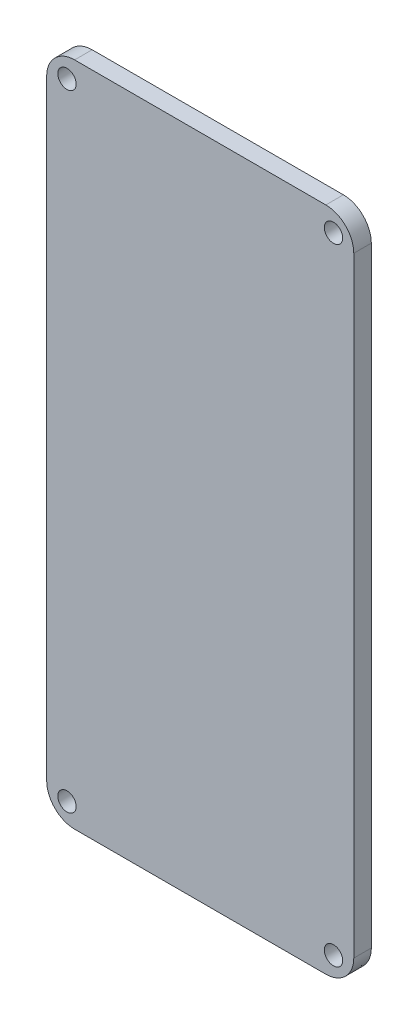
ISO-10303-21;
HEADER;
FILE_DESCRIPTION(('STEP AP214'),'2;1');
FILE_NAME('part.step','',(''),(''),'','','');
FILE_SCHEMA(('AUTOMOTIVE_DESIGN { 1 0 10303 214 1 1 1 1 }'));
ENDSEC;
DATA;
#1=APPLICATION_CONTEXT('core data for automotive mechanical design processes');
#2=APPLICATION_PROTOCOL_DEFINITION('international standard','automotive_design',2000,#1);
#3=PRODUCT_CONTEXT('',#1,'mechanical');
#4=PRODUCT('Part','Part','',(#3));
#5=PRODUCT_RELATED_PRODUCT_CATEGORY('part','',(#4));
#6=PRODUCT_DEFINITION_FORMATION('','',#4);
#7=PRODUCT_DEFINITION_CONTEXT('part definition',#1,'design');
#8=PRODUCT_DEFINITION('design','',#6,#7);
#9=PRODUCT_DEFINITION_SHAPE('','',#8);
#10=(LENGTH_UNIT() NAMED_UNIT(*) SI_UNIT(.MILLI.,.METRE.));
#11=(NAMED_UNIT(*) PLANE_ANGLE_UNIT() SI_UNIT($,.RADIAN.));
#12=(NAMED_UNIT(*) SI_UNIT($,.STERADIAN.) SOLID_ANGLE_UNIT());
#13=UNCERTAINTY_MEASURE_WITH_UNIT(LENGTH_MEASURE(1.E-05),#10,'distance_accuracy_value','');
#14=(GEOMETRIC_REPRESENTATION_CONTEXT(3) GLOBAL_UNCERTAINTY_ASSIGNED_CONTEXT((#13)) GLOBAL_UNIT_ASSIGNED_CONTEXT((#10,
#11,#12)) REPRESENTATION_CONTEXT('',''));
#15=CARTESIAN_POINT('',(0.,0.,0.));
#16=DIRECTION('',(0.,0.,1.));
#17=DIRECTION('',(1.,0.,0.));
#18=AXIS2_PLACEMENT_3D('',#15,#16,#17);
#19=CARTESIAN_POINT('',(15.9393993481628,54.3958704339727,3.));
#20=DIRECTION('',(0.,0.,1.));
#21=DIRECTION('',(1.,0.,0.));
#22=AXIS2_PLACEMENT_3D('',#19,#20,#21);
#23=PLANE('',#22);
#24=CARTESIAN_POINT('',(-31.7271852056061,-54.7317695398175,3.));
#25=DIRECTION('',(0.,0.,1.));
#26=DIRECTION('',(-1.,0.,0.));
#27=AXIS2_PLACEMENT_3D('',#24,#25,#26);
#28=ELLIPSE('',#27,1.57121739092703,1.57121739092703);
#29=CARTESIAN_POINT('',(-33.2984025965332,-54.7317695398175,3.));
#30=VERTEX_POINT('',#29);
#31=EDGE_CURVE('E365',#30,#30,#28,.T.);
#32=ORIENTED_EDGE('',*,*,#31,.F.);
#33=EDGE_LOOP('',(#32));
#34=FACE_BOUND('',#33,.T.);
#35=CARTESIAN_POINT('',(-31.7271852056061,52.3290999996864,3.));
#36=DIRECTION('',(0.,0.,1.));
#37=DIRECTION('',(-1.,0.,0.));
#38=AXIS2_PLACEMENT_3D('',#35,#36,#37);
#39=ELLIPSE('',#38,1.57121739092703,1.57121739092703);
#40=CARTESIAN_POINT('',(-33.2984025965332,52.3290999996864,3.));
#41=VERTEX_POINT('',#40);
#42=EDGE_CURVE('E196',#41,#41,#39,.T.);
#43=ORIENTED_EDGE('',*,*,#42,.F.);
#44=EDGE_LOOP('',(#43));
#45=FACE_BOUND('',#44,.T.);
#46=CARTESIAN_POINT('',(17.3423799999998,51.0226600000001,3.));
#47=CARTESIAN_POINT('',(17.3423799999998,53.6496165211084,3.));
#48=CARTESIAN_POINT('',(15.1931330439942,55.798863477114,3.));
#49=CARTESIAN_POINT('',(12.5662756533208,55.798863477114,3.));
#50=B_SPLINE_CURVE_WITH_KNOTS('',3,(#46,#47,#48,#49),.UNSPECIFIED.,.F.,.F.,(4,4),
(0.111111111111111,0.222222222222222),.UNSPECIFIED.);
#51=CARTESIAN_POINT('',(17.3423799999998,51.0226600000001,3.));
#52=VERTEX_POINT('',#51);
#53=CARTESIAN_POINT('',(12.5662756533208,55.798863477114,3.));
#54=VERTEX_POINT('',#53);
#55=EDGE_CURVE('E206',#52,#54,#50,.T.);
#56=ORIENTED_EDGE('',*,*,#55,.T.);
#57=DIRECTION('',(-1.,0.,0.));
#58=VECTOR('',#57,1.);
#59=CARTESIAN_POINT('',(-30.4205469450504,55.798863477114,3.));
#60=LINE('',#59,#58);
#61=CARTESIAN_POINT('',(-30.4205469450504,55.798863477114,3.));
#62=VERTEX_POINT('',#61);
#63=EDGE_CURVE('E94',#54,#62,#60,.T.);
#64=ORIENTED_EDGE('',*,*,#63,.T.);
#65=CARTESIAN_POINT('',(-30.4205469450504,55.798863477114,3.));
#66=CARTESIAN_POINT('',(-33.0474043357237,55.798863477114,3.));
#67=CARTESIAN_POINT('',(-35.1967504221641,53.6496165211084,3.));
#68=CARTESIAN_POINT('',(-35.1967504221641,51.0226600000001,3.));
#69=B_SPLINE_CURVE_WITH_KNOTS('',3,(#65,#66,#67,#68),.UNSPECIFIED.,.F.,.F.,(4,4),
(0.777777777777778,1.),.UNSPECIFIED.);
#70=CARTESIAN_POINT('',(-35.1967504221641,51.0226600000001,3.));
#71=VERTEX_POINT('',#70);
#72=EDGE_CURVE('E160',#62,#71,#69,.T.);
#73=ORIENTED_EDGE('',*,*,#72,.T.);
#74=DIRECTION('',(0.,-1.,0.));
#75=VECTOR('',#74,1.);
#76=CARTESIAN_POINT('',(-35.1967504221641,-53.425032148827,3.));
#77=LINE('',#76,#75);
#78=CARTESIAN_POINT('',(-35.1967504221641,-53.425032148827,3.));
#79=VERTEX_POINT('',#78);
#80=EDGE_CURVE('E155',#71,#79,#77,.T.);
#81=ORIENTED_EDGE('',*,*,#80,.T.);
#82=CARTESIAN_POINT('',(-35.1967504221641,-53.425032148827,3.));
#83=CARTESIAN_POINT('',(-35.1967504221641,-56.0519886699353,3.));
#84=CARTESIAN_POINT('',(-33.0474043357237,-58.2012356259407,3.));
#85=CARTESIAN_POINT('',(-30.4205469450504,-58.2012356259407,3.));
#86=B_SPLINE_CURVE_WITH_KNOTS('',3,(#82,#83,#84,#85),.UNSPECIFIED.,.F.,.F.,(4,4),
(0.555555555555556,0.666666666666667),.UNSPECIFIED.);
#87=CARTESIAN_POINT('',(-30.4205469450504,-58.2012356259407,3.));
#88=VERTEX_POINT('',#87);
#89=EDGE_CURVE('E113',#79,#88,#86,.T.);
#90=ORIENTED_EDGE('',*,*,#89,.T.);
#91=DIRECTION('',(1.,0.,0.));
#92=VECTOR('',#91,1.);
#93=CARTESIAN_POINT('',(12.5662756533208,-58.2012356259407,3.));
#94=LINE('',#93,#92);
#95=CARTESIAN_POINT('',(12.5662756533208,-58.2012356259407,3.));
#96=VERTEX_POINT('',#95);
#97=EDGE_CURVE('E107',#88,#96,#94,.T.);
#98=ORIENTED_EDGE('',*,*,#97,.T.);
#99=CARTESIAN_POINT('',(12.5662756533208,-58.2012356259407,3.));
#100=CARTESIAN_POINT('',(15.1931330439942,-58.2012356259407,3.));
#101=CARTESIAN_POINT('',(17.3423799999998,-56.0519886699353,3.));
#102=CARTESIAN_POINT('',(17.3423799999998,-53.425032148827,3.));
#103=B_SPLINE_CURVE_WITH_KNOTS('',3,(#99,#100,#101,#102),.UNSPECIFIED.,.F.,.F.,(4,4),
(0.333333333333333,0.444444444444444),.UNSPECIFIED.);
#104=CARTESIAN_POINT('',(17.3423799999998,-53.425032148827,3.));
#105=VERTEX_POINT('',#104);
#106=EDGE_CURVE('E111',#96,#105,#103,.T.);
#107=ORIENTED_EDGE('',*,*,#106,.T.);
#108=DIRECTION('',(0.,1.,0.));
#109=VECTOR('',#108,1.);
#110=CARTESIAN_POINT('',(17.3423799999998,51.0226600000001,3.));
#111=LINE('',#110,#109);
#112=EDGE_CURVE('E51',#105,#52,#111,.T.);
#113=ORIENTED_EDGE('',*,*,#112,.T.);
#114=EDGE_LOOP('',(#56,#64,#73,#81,#90,#98,#107,#113));
#115=FACE_BOUND('',#114,.T.);
#116=CARTESIAN_POINT('',(13.8728147834418,52.3290999996864,3.));
#117=DIRECTION('',(0.,0.,1.));
#118=DIRECTION('',(0.,1.,0.));
#119=AXIS2_PLACEMENT_3D('',#116,#117,#118);
#120=ELLIPSE('',#119,1.57121739092703,1.5712173909268);
#121=CARTESIAN_POINT('',(13.8728147834418,53.9003173906134,3.));
#122=VERTEX_POINT('',#121);
#123=EDGE_CURVE('E205',#122,#122,#120,.T.);
#124=ORIENTED_EDGE('',*,*,#123,.F.);
#125=EDGE_LOOP('',(#124));
#126=FACE_BOUND('',#125,.T.);
#127=CARTESIAN_POINT('',(13.8728147834418,-54.7317695398175,3.));
#128=DIRECTION('',(0.,0.,1.));
#129=DIRECTION('',(0.,1.,0.));
#130=AXIS2_PLACEMENT_3D('',#127,#128,#129);
#131=ELLIPSE('',#130,1.57121739092703,1.5712173909268);
#132=CARTESIAN_POINT('',(13.8728147834418,-53.1605521488905,3.));
#133=VERTEX_POINT('',#132);
#134=EDGE_CURVE('E359',#133,#133,#131,.T.);
#135=ORIENTED_EDGE('',*,*,#134,.F.);
#136=EDGE_LOOP('',(#135));
#137=FACE_BOUND('',#136,.T.);
#138=ADVANCED_FACE('F33',(#34,#45,#115,#126,#137),#23,.T.);
#139=CARTESIAN_POINT('',(15.9393993481628,54.3958704339727,0.));
#140=DIRECTION('',(0.,0.,1.));
#141=DIRECTION('',(1.,0.,0.));
#142=AXIS2_PLACEMENT_3D('',#139,#140,#141);
#143=PLANE('',#142);
#144=CARTESIAN_POINT('',(17.3423799999998,51.0226600000001,0.));
#145=CARTESIAN_POINT('',(17.3423799999998,53.6496165211084,0.));
#146=CARTESIAN_POINT('',(15.1931330439942,55.798863477114,0.));
#147=CARTESIAN_POINT('',(12.5662756533208,55.798863477114,0.));
#148=B_SPLINE_CURVE_WITH_KNOTS('',3,(#144,#145,#146,#147),.UNSPECIFIED.,.F.,.F.,(4,4),
(0.111111111111111,0.222222222222222),.UNSPECIFIED.);
#149=CARTESIAN_POINT('',(17.3423799999998,51.0226600000001,0.));
#150=VERTEX_POINT('',#149);
#151=CARTESIAN_POINT('',(12.5662756533208,55.798863477114,0.));
#152=VERTEX_POINT('',#151);
#153=EDGE_CURVE('E201',#150,#152,#148,.T.);
#154=ORIENTED_EDGE('',*,*,#153,.F.);
#155=DIRECTION('',(0.,1.,0.));
#156=VECTOR('',#155,1.);
#157=CARTESIAN_POINT('',(17.3423799999998,51.0226600000001,0.));
#158=LINE('',#157,#156);
#159=CARTESIAN_POINT('',(17.3423799999998,-53.425032148827,0.));
#160=VERTEX_POINT('',#159);
#161=EDGE_CURVE('E86',#160,#150,#158,.T.);
#162=ORIENTED_EDGE('',*,*,#161,.F.);
#163=CARTESIAN_POINT('',(12.5662756533208,-58.2012356259407,0.));
#164=CARTESIAN_POINT('',(15.1931330439942,-58.2012356259407,0.));
#165=CARTESIAN_POINT('',(17.3423799999998,-56.0519886699353,0.));
#166=CARTESIAN_POINT('',(17.3423799999998,-53.425032148827,0.));
#167=B_SPLINE_CURVE_WITH_KNOTS('',3,(#163,#164,#165,#166),.UNSPECIFIED.,.F.,.F.,(4,4),
(0.333333333333333,0.444444444444444),.UNSPECIFIED.);
#168=CARTESIAN_POINT('',(12.5662756533208,-58.2012356259407,0.));
#169=VERTEX_POINT('',#168);
#170=EDGE_CURVE('E80',#169,#160,#167,.T.);
#171=ORIENTED_EDGE('',*,*,#170,.F.);
#172=DIRECTION('',(1.,0.,0.));
#173=VECTOR('',#172,1.);
#174=CARTESIAN_POINT('',(12.5662756533208,-58.2012356259407,0.));
#175=LINE('',#174,#173);
#176=CARTESIAN_POINT('',(-30.4205469450504,-58.2012356259407,0.));
#177=VERTEX_POINT('',#176);
#178=EDGE_CURVE('E121',#177,#169,#175,.T.);
#179=ORIENTED_EDGE('',*,*,#178,.F.);
#180=CARTESIAN_POINT('',(-35.1967504221641,-53.425032148827,0.));
#181=CARTESIAN_POINT('',(-35.1967504221641,-56.0519886699353,0.));
#182=CARTESIAN_POINT('',(-33.0474043357237,-58.2012356259407,0.));
#183=CARTESIAN_POINT('',(-30.4205469450504,-58.2012356259407,0.));
#184=B_SPLINE_CURVE_WITH_KNOTS('',3,(#180,#181,#182,#183),.UNSPECIFIED.,.F.,.F.,(4,4),
(0.555555555555556,0.666666666666667),.UNSPECIFIED.);
#185=CARTESIAN_POINT('',(-35.1967504221641,-53.425032148827,0.));
#186=VERTEX_POINT('',#185);
#187=EDGE_CURVE('E241',#186,#177,#184,.T.);
#188=ORIENTED_EDGE('',*,*,#187,.F.);
#189=DIRECTION('',(0.,-1.,0.));
#190=VECTOR('',#189,1.);
#191=CARTESIAN_POINT('',(-35.1967504221641,-53.425032148827,0.));
#192=LINE('',#191,#190);
#193=CARTESIAN_POINT('',(-35.1967504221641,51.0226600000001,0.));
#194=VERTEX_POINT('',#193);
#195=EDGE_CURVE('E239',#194,#186,#192,.T.);
#196=ORIENTED_EDGE('',*,*,#195,.F.);
#197=CARTESIAN_POINT('',(-30.4205469450504,55.798863477114,0.));
#198=CARTESIAN_POINT('',(-33.0474043357237,55.798863477114,0.));
#199=CARTESIAN_POINT('',(-35.1967504221641,53.6496165211084,0.));
#200=CARTESIAN_POINT('',(-35.1967504221641,51.0226600000001,0.));
#201=B_SPLINE_CURVE_WITH_KNOTS('',3,(#197,#198,#199,#200),.UNSPECIFIED.,.F.,.F.,(4,4),
(0.777777777777778,1.),.UNSPECIFIED.);
#202=CARTESIAN_POINT('',(-30.4205469450504,55.798863477114,0.));
#203=VERTEX_POINT('',#202);
#204=EDGE_CURVE('E233',#203,#194,#201,.T.);
#205=ORIENTED_EDGE('',*,*,#204,.F.);
#206=DIRECTION('',(-1.,0.,0.));
#207=VECTOR('',#206,1.);
#208=CARTESIAN_POINT('',(-30.4205469450504,55.798863477114,0.));
#209=LINE('',#208,#207);
#210=EDGE_CURVE('E237',#152,#203,#209,.T.);
#211=ORIENTED_EDGE('',*,*,#210,.F.);
#212=EDGE_LOOP('',(#154,#162,#171,#179,#188,#196,#205,#211));
#213=FACE_BOUND('',#212,.T.);
#214=CARTESIAN_POINT('',(-31.7271852056061,52.3290999996864,0.));
#215=DIRECTION('',(0.,0.,1.));
#216=DIRECTION('',(-1.,0.,0.));
#217=AXIS2_PLACEMENT_3D('',#214,#215,#216);
#218=ELLIPSE('',#217,1.57121739092703,1.57121739092703);
#219=CARTESIAN_POINT('',(-33.2984025965332,52.3290999996864,0.));
#220=VERTEX_POINT('',#219);
#221=EDGE_CURVE('E202',#220,#220,#218,.T.);
#222=ORIENTED_EDGE('',*,*,#221,.T.);
#223=EDGE_LOOP('',(#222));
#224=FACE_BOUND('',#223,.T.);
#225=CARTESIAN_POINT('',(13.8728147834418,52.3290999996864,0.));
#226=DIRECTION('',(0.,0.,1.));
#227=DIRECTION('',(0.,1.,0.));
#228=AXIS2_PLACEMENT_3D('',#225,#226,#227);
#229=ELLIPSE('',#228,1.57121739092703,1.5712173909268);
#230=CARTESIAN_POINT('',(13.8728147834418,53.9003173906134,0.));
#231=VERTEX_POINT('',#230);
#232=EDGE_CURVE('E203',#231,#231,#229,.T.);
#233=ORIENTED_EDGE('',*,*,#232,.T.);
#234=EDGE_LOOP('',(#233));
#235=FACE_BOUND('',#234,.T.);
#236=CARTESIAN_POINT('',(-31.7271852056061,-54.7317695398175,0.));
#237=DIRECTION('',(0.,0.,1.));
#238=DIRECTION('',(-1.,0.,0.));
#239=AXIS2_PLACEMENT_3D('',#236,#237,#238);
#240=ELLIPSE('',#239,1.57121739092703,1.57121739092703);
#241=CARTESIAN_POINT('',(-33.2984025965332,-54.7317695398175,0.));
#242=VERTEX_POINT('',#241);
#243=EDGE_CURVE('E362',#242,#242,#240,.T.);
#244=ORIENTED_EDGE('',*,*,#243,.T.);
#245=EDGE_LOOP('',(#244));
#246=FACE_BOUND('',#245,.T.);
#247=CARTESIAN_POINT('',(13.8728147834418,-54.7317695398175,0.));
#248=DIRECTION('',(0.,0.,1.));
#249=DIRECTION('',(0.,1.,0.));
#250=AXIS2_PLACEMENT_3D('',#247,#248,#249);
#251=ELLIPSE('',#250,1.57121739092703,1.5712173909268);
#252=CARTESIAN_POINT('',(13.8728147834418,-53.1605521488905,0.));
#253=VERTEX_POINT('',#252);
#254=EDGE_CURVE('E363',#253,#253,#251,.T.);
#255=ORIENTED_EDGE('',*,*,#254,.T.);
#256=EDGE_LOOP('',(#255));
#257=FACE_BOUND('',#256,.T.);
#258=ADVANCED_FACE('F176',(#213,#224,#235,#246,#257),#143,.F.);
#259=DIRECTION('',(0.,0.,-1.));
#260=VECTOR('',#259,1.);
#261=SURFACE_OF_LINEAR_EXTRUSION('',#50,#260);
#262=ORIENTED_EDGE('',*,*,#153,.T.);
#263=DIRECTION('',(0.,0.,-1.));
#264=VECTOR('',#263,1.);
#265=CARTESIAN_POINT('',(12.5662756533208,55.798863477114,3.));
#266=LINE('',#265,#264);
#267=EDGE_CURVE('E11',#54,#152,#266,.T.);
#268=ORIENTED_EDGE('',*,*,#267,.F.);
#269=ORIENTED_EDGE('',*,*,#55,.F.);
#270=DIRECTION('',(0.,0.,-1.));
#271=VECTOR('',#270,1.);
#272=CARTESIAN_POINT('',(17.3423799999998,51.0226600000001,3.));
#273=LINE('',#272,#271);
#274=EDGE_CURVE('E127',#52,#150,#273,.T.);
#275=ORIENTED_EDGE('',*,*,#274,.T.);
#276=EDGE_LOOP('',(#262,#268,#269,#275));
#277=FACE_BOUND('',#276,.T.);
#278=ADVANCED_FACE('F35',(#277),#261,.F.);
#279=CARTESIAN_POINT('',(-30.4205469450504,55.798863477114,3.));
#280=DIRECTION('',(0.,-1.,0.));
#281=DIRECTION('',(0.,0.,-1.));
#282=AXIS2_PLACEMENT_3D('',#279,#280,#281);
#283=PLANE('',#282);
#284=ORIENTED_EDGE('',*,*,#210,.T.);
#285=DIRECTION('',(0.,0.,-1.));
#286=VECTOR('',#285,1.);
#287=CARTESIAN_POINT('',(-30.4205469450504,55.798863477114,3.));
#288=LINE('',#287,#286);
#289=EDGE_CURVE('E43',#62,#203,#288,.T.);
#290=ORIENTED_EDGE('',*,*,#289,.F.);
#291=ORIENTED_EDGE('',*,*,#63,.F.);
#292=ORIENTED_EDGE('',*,*,#267,.T.);
#293=EDGE_LOOP('',(#284,#290,#291,#292));
#294=FACE_BOUND('',#293,.T.);
#295=ADVANCED_FACE('F170',(#294),#283,.F.);
#296=DIRECTION('',(0.,0.,-1.));
#297=VECTOR('',#296,1.);
#298=SURFACE_OF_LINEAR_EXTRUSION('',#69,#297);
#299=ORIENTED_EDGE('',*,*,#204,.T.);
#300=DIRECTION('',(0.,0.,-1.));
#301=VECTOR('',#300,1.);
#302=CARTESIAN_POINT('',(-35.1967504221641,51.0226600000001,3.));
#303=LINE('',#302,#301);
#304=EDGE_CURVE('E227',#71,#194,#303,.T.);
#305=ORIENTED_EDGE('',*,*,#304,.F.);
#306=ORIENTED_EDGE('',*,*,#72,.F.);
#307=ORIENTED_EDGE('',*,*,#289,.T.);
#308=EDGE_LOOP('',(#299,#305,#306,#307));
#309=FACE_BOUND('',#308,.T.);
#310=ADVANCED_FACE('F168',(#309),#298,.F.);
#311=CARTESIAN_POINT('',(-35.1967504221641,-53.425032148827,3.));
#312=DIRECTION('',(1.,0.,0.));
#313=DIRECTION('',(0.,0.,-1.));
#314=AXIS2_PLACEMENT_3D('',#311,#312,#313);
#315=PLANE('',#314);
#316=ORIENTED_EDGE('',*,*,#195,.T.);
#317=DIRECTION('',(0.,0.,-1.));
#318=VECTOR('',#317,1.);
#319=CARTESIAN_POINT('',(-35.1967504221641,-53.425032148827,3.));
#320=LINE('',#319,#318);
#321=EDGE_CURVE('E224',#79,#186,#320,.T.);
#322=ORIENTED_EDGE('',*,*,#321,.F.);
#323=ORIENTED_EDGE('',*,*,#80,.F.);
#324=ORIENTED_EDGE('',*,*,#304,.T.);
#325=EDGE_LOOP('',(#316,#322,#323,#324));
#326=FACE_BOUND('',#325,.T.);
#327=ADVANCED_FACE('F148',(#326),#315,.F.);
#328=DIRECTION('',(0.,0.,-1.));
#329=VECTOR('',#328,1.);
#330=SURFACE_OF_LINEAR_EXTRUSION('',#86,#329);
#331=ORIENTED_EDGE('',*,*,#187,.T.);
#332=DIRECTION('',(0.,0.,-1.));
#333=VECTOR('',#332,1.);
#334=CARTESIAN_POINT('',(-30.4205469450504,-58.2012356259407,3.));
#335=LINE('',#334,#333);
#336=EDGE_CURVE('E122',#88,#177,#335,.T.);
#337=ORIENTED_EDGE('',*,*,#336,.F.);
#338=ORIENTED_EDGE('',*,*,#89,.F.);
#339=ORIENTED_EDGE('',*,*,#321,.T.);
#340=EDGE_LOOP('',(#331,#337,#338,#339));
#341=FACE_BOUND('',#340,.T.);
#342=ADVANCED_FACE('F145',(#341),#330,.F.);
#343=CARTESIAN_POINT('',(12.5662756533208,-58.2012356259407,3.));
#344=DIRECTION('',(0.,1.,0.));
#345=DIRECTION('',(0.,0.,1.));
#346=AXIS2_PLACEMENT_3D('',#343,#344,#345);
#347=PLANE('',#346);
#348=ORIENTED_EDGE('',*,*,#178,.T.);
#349=DIRECTION('',(0.,0.,-1.));
#350=VECTOR('',#349,1.);
#351=CARTESIAN_POINT('',(12.5662756533208,-58.2012356259407,3.));
#352=LINE('',#351,#350);
#353=EDGE_CURVE('E118',#96,#169,#352,.T.);
#354=ORIENTED_EDGE('',*,*,#353,.F.);
#355=ORIENTED_EDGE('',*,*,#97,.F.);
#356=ORIENTED_EDGE('',*,*,#336,.T.);
#357=EDGE_LOOP('',(#348,#354,#355,#356));
#358=FACE_BOUND('',#357,.T.);
#359=ADVANCED_FACE('F119',(#358),#347,.F.);
#360=DIRECTION('',(0.,0.,-1.));
#361=VECTOR('',#360,1.);
#362=SURFACE_OF_LINEAR_EXTRUSION('',#103,#361);
#363=ORIENTED_EDGE('',*,*,#170,.T.);
#364=DIRECTION('',(0.,0.,-1.));
#365=VECTOR('',#364,1.);
#366=CARTESIAN_POINT('',(17.3423799999998,-53.425032148827,3.));
#367=LINE('',#366,#365);
#368=EDGE_CURVE('E123',#105,#160,#367,.T.);
#369=ORIENTED_EDGE('',*,*,#368,.F.);
#370=ORIENTED_EDGE('',*,*,#106,.F.);
#371=ORIENTED_EDGE('',*,*,#353,.T.);
#372=EDGE_LOOP('',(#363,#369,#370,#371));
#373=FACE_BOUND('',#372,.T.);
#374=ADVANCED_FACE('F125',(#373),#362,.F.);
#375=CARTESIAN_POINT('',(17.3423799999998,51.0226600000001,3.));
#376=DIRECTION('',(-1.,0.,0.));
#377=DIRECTION('',(0.,0.,1.));
#378=AXIS2_PLACEMENT_3D('',#375,#376,#377);
#379=PLANE('',#378);
#380=ORIENTED_EDGE('',*,*,#161,.T.);
#381=ORIENTED_EDGE('',*,*,#274,.F.);
#382=ORIENTED_EDGE('',*,*,#112,.F.);
#383=ORIENTED_EDGE('',*,*,#368,.T.);
#384=EDGE_LOOP('',(#380,#381,#382,#383));
#385=FACE_BOUND('',#384,.T.);
#386=ADVANCED_FACE('F141',(#385),#379,.F.);
#387=DIRECTION('',(0.,0.,-1.));
#388=VECTOR('',#387,1.);
#389=SURFACE_OF_LINEAR_EXTRUSION('',#39,#388);
#390=ORIENTED_EDGE('',*,*,#42,.T.);
#391=EDGE_LOOP('',(#390));
#392=FACE_BOUND('',#391,.T.);
#393=ORIENTED_EDGE('',*,*,#221,.F.);
#394=EDGE_LOOP('',(#393));
#395=FACE_BOUND('',#394,.T.);
#396=ADVANCED_FACE('F188',(#392,#395),#389,.T.);
#397=DIRECTION('',(0.,0.,-1.));
#398=VECTOR('',#397,1.);
#399=SURFACE_OF_LINEAR_EXTRUSION('',#120,#398);
#400=ORIENTED_EDGE('',*,*,#123,.T.);
#401=EDGE_LOOP('',(#400));
#402=FACE_BOUND('',#401,.T.);
#403=ORIENTED_EDGE('',*,*,#232,.F.);
#404=EDGE_LOOP('',(#403));
#405=FACE_BOUND('',#404,.T.);
#406=ADVANCED_FACE('F192',(#402,#405),#399,.T.);
#407=DIRECTION('',(0.,0.,-1.));
#408=VECTOR('',#407,1.);
#409=SURFACE_OF_LINEAR_EXTRUSION('',#28,#408);
#410=ORIENTED_EDGE('',*,*,#31,.T.);
#411=EDGE_LOOP('',(#410));
#412=FACE_BOUND('',#411,.T.);
#413=ORIENTED_EDGE('',*,*,#243,.F.);
#414=EDGE_LOOP('',(#413));
#415=FACE_BOUND('',#414,.T.);
#416=ADVANCED_FACE('F277',(#412,#415),#409,.T.);
#417=DIRECTION('',(0.,0.,-1.));
#418=VECTOR('',#417,1.);
#419=SURFACE_OF_LINEAR_EXTRUSION('',#131,#418);
#420=ORIENTED_EDGE('',*,*,#134,.T.);
#421=EDGE_LOOP('',(#420));
#422=FACE_BOUND('',#421,.T.);
#423=ORIENTED_EDGE('',*,*,#254,.F.);
#424=EDGE_LOOP('',(#423));
#425=FACE_BOUND('',#424,.T.);
#426=ADVANCED_FACE('F284',(#422,#425),#419,.T.);
#427=CLOSED_SHELL('',(#138,#258,#278,#295,#310,#327,#342,#359,#374,#386,#396,#406,#416,#426));
#428=MANIFOLD_SOLID_BREP('B2',#427);
#429=ADVANCED_BREP_SHAPE_REPRESENTATION('',(#18,#428),#14);
#430=SHAPE_DEFINITION_REPRESENTATION(#9,#429);
ENDSEC;
END-ISO-10303-21;
